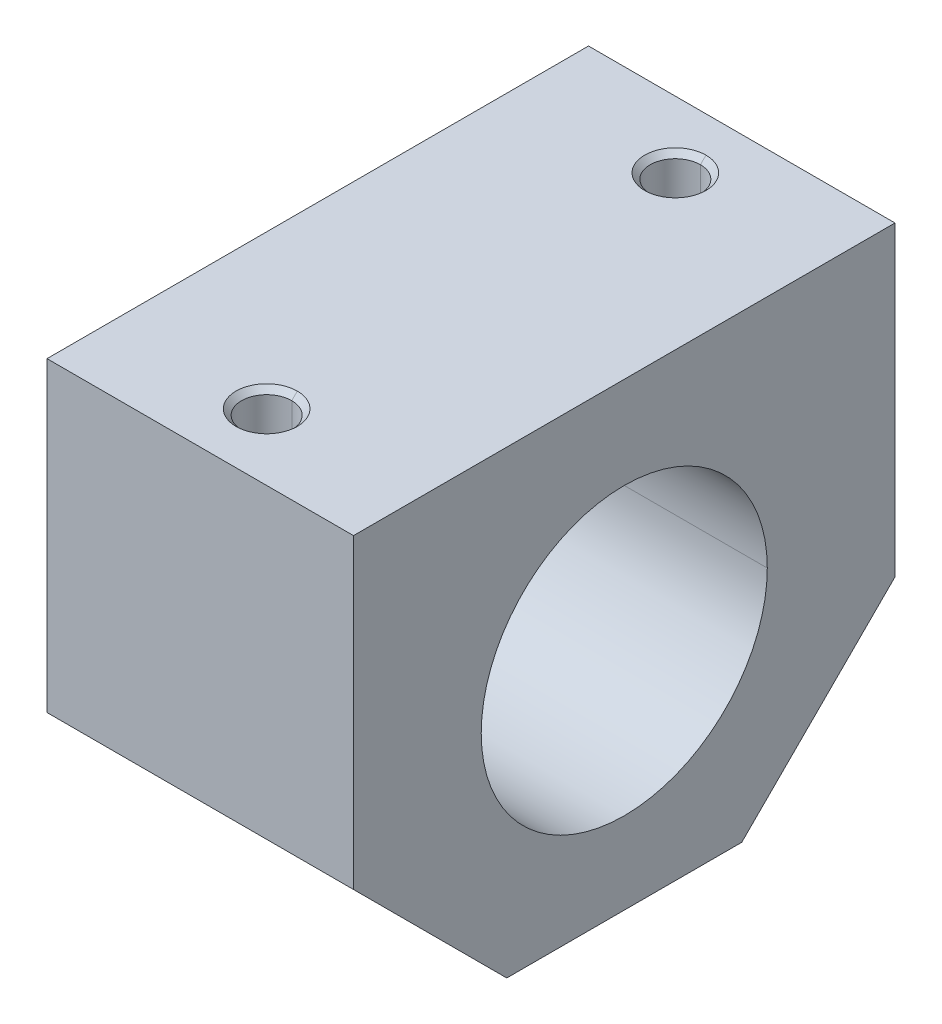
ISO-10303-21;
HEADER;
FILE_DESCRIPTION(('STEP AP214'),'2;1');
FILE_NAME('part.step','',(''),(''),'','','');
FILE_SCHEMA(('AUTOMOTIVE_DESIGN { 1 0 10303 214 1 1 1 1 }'));
ENDSEC;
DATA;
#1=APPLICATION_CONTEXT('core data for automotive mechanical design processes');
#2=APPLICATION_PROTOCOL_DEFINITION('international standard','automotive_design',2000,#1);
#3=PRODUCT_CONTEXT('',#1,'mechanical');
#4=PRODUCT('Part','Part','',(#3));
#5=PRODUCT_RELATED_PRODUCT_CATEGORY('part','',(#4));
#6=PRODUCT_DEFINITION_FORMATION('','',#4);
#7=PRODUCT_DEFINITION_CONTEXT('part definition',#1,'design');
#8=PRODUCT_DEFINITION('design','',#6,#7);
#9=PRODUCT_DEFINITION_SHAPE('','',#8);
#10=(LENGTH_UNIT() NAMED_UNIT(*) SI_UNIT(.MILLI.,.METRE.));
#11=(NAMED_UNIT(*) PLANE_ANGLE_UNIT() SI_UNIT($,.RADIAN.));
#12=(NAMED_UNIT(*) SI_UNIT($,.STERADIAN.) SOLID_ANGLE_UNIT());
#13=UNCERTAINTY_MEASURE_WITH_UNIT(LENGTH_MEASURE(1.E-05),#10,'distance_accuracy_value','');
#14=(GEOMETRIC_REPRESENTATION_CONTEXT(3) GLOBAL_UNCERTAINTY_ASSIGNED_CONTEXT((#13)) GLOBAL_UNIT_ASSIGNED_CONTEXT((#10,
#11,#12)) REPRESENTATION_CONTEXT('',''));
#15=CARTESIAN_POINT('',(0.,0.,0.));
#16=DIRECTION('',(0.,0.,1.));
#17=DIRECTION('',(1.,0.,0.));
#18=AXIS2_PLACEMENT_3D('',#15,#16,#17);
#19=CARTESIAN_POINT('',(15.,-22.,-11.5));
#20=DIRECTION('',(0.,0.707106781186548,0.707106781186548));
#21=DIRECTION('',(0.,-0.707106781186548,0.707106781186548));
#22=AXIS2_PLACEMENT_3D('',#19,#20,#21);
#23=PLANE('',#22);
#24=CARTESIAN_POINT('',(0.,-18.800000000016,-14.699999999984));
#25=CARTESIAN_POINT('',(5.3,-18.800000000016,-14.699999999984));
#26=CARTESIAN_POINT('',(5.3,-13.4999250462421,-20.0000749537579));
#27=CARTESIAN_POINT('',(5.29985009460424,-8.19999999998402,-25.300000000016));
#28=CARTESIAN_POINT('',(0.,-8.19999999998402,-25.300000000016));
#29=(BOUNDED_CURVE() B_SPLINE_CURVE(2,(#24,#25,#26,#27,#28),.UNSPECIFIED.,.F.,
.F.) B_SPLINE_CURVE_WITH_KNOTS((3,1,1,3),(0.,0.5,0.50001,1.),
.UNSPECIFIED.) CURVE() GEOMETRIC_REPRESENTATION_ITEM() RATIONAL_B_SPLINE_CURVE((1.,
0.707106781186547,0.999994142135624,0.707112639050924,1.)) REPRESENTATION_ITEM(''));
#30=CARTESIAN_POINT('',(0.,-18.8,-14.7));
#31=VERTEX_POINT('',#30);
#32=CARTESIAN_POINT('',(0.,-8.19999999998402,-25.3));
#33=VERTEX_POINT('',#32);
#34=EDGE_CURVE('E11',#31,#33,#29,.T.);
#35=ORIENTED_EDGE('',*,*,#34,.T.);
#36=CARTESIAN_POINT('',(0.,-8.19999999998402,-25.300000000016));
#37=CARTESIAN_POINT('',(-5.30000000000001,-8.19999999998402,-25.300000000016));
#38=CARTESIAN_POINT('',(-5.30000000000001,-13.5000749537579,-19.9999250462421));
#39=CARTESIAN_POINT('',(-5.29985009460425,-18.800000000016,-14.699999999984));
#40=CARTESIAN_POINT('',(0.,-18.800000000016,-14.699999999984));
#41=(BOUNDED_CURVE() B_SPLINE_CURVE(2,(#36,#37,#38,#39,#40),.UNSPECIFIED.,.F.,
.F.) B_SPLINE_CURVE_WITH_KNOTS((3,1,1,3),(0.,0.5,0.50001,1.),
.UNSPECIFIED.) CURVE() GEOMETRIC_REPRESENTATION_ITEM() RATIONAL_B_SPLINE_CURVE((1.,
0.707106781186548,0.999994142135624,0.707112639050924,1.)) REPRESENTATION_ITEM(''));
#42=EDGE_CURVE('E26',#33,#31,#41,.T.);
#43=ORIENTED_EDGE('',*,*,#42,.T.);
#44=EDGE_LOOP('',(#35,#43));
#45=FACE_BOUND('',#44,.T.);
#46=DIRECTION('',(0.,0.707106781186548,-0.707106781186548));
#47=VECTOR('',#46,1.);
#48=CARTESIAN_POINT('',(-15.,-22.,-11.5));
#49=LINE('',#48,#47);
#50=CARTESIAN_POINT('',(-15.,-22.,-11.5));
#51=VERTEX_POINT('',#50);
#52=CARTESIAN_POINT('',(-15.,-7.,-26.5));
#53=VERTEX_POINT('',#52);
#54=EDGE_CURVE('E636',#51,#53,#49,.T.);
#55=ORIENTED_EDGE('',*,*,#54,.T.);
#56=DIRECTION('',(-1.,0.,0.));
#57=VECTOR('',#56,1.);
#58=CARTESIAN_POINT('',(15.,-7.,-26.5));
#59=LINE('',#58,#57);
#60=CARTESIAN_POINT('',(15.,-7.,-26.5));
#61=VERTEX_POINT('',#60);
#62=EDGE_CURVE('E630',#61,#53,#59,.T.);
#63=ORIENTED_EDGE('',*,*,#62,.F.);
#64=DIRECTION('',(0.,0.707106781186548,-0.707106781186548));
#65=VECTOR('',#64,1.);
#66=CARTESIAN_POINT('',(15.,-22.,-11.5));
#67=LINE('',#66,#65);
#68=CARTESIAN_POINT('',(15.,-22.,-11.5));
#69=VERTEX_POINT('',#68);
#70=EDGE_CURVE('E624',#69,#61,#67,.T.);
#71=ORIENTED_EDGE('',*,*,#70,.F.);
#72=DIRECTION('',(-1.,0.,0.));
#73=VECTOR('',#72,1.);
#74=CARTESIAN_POINT('',(15.,-22.,-11.5));
#75=LINE('',#74,#73);
#76=EDGE_CURVE('E619',#69,#51,#75,.T.);
#77=ORIENTED_EDGE('',*,*,#76,.T.);
#78=EDGE_LOOP('',(#55,#63,#71,#77));
#79=FACE_BOUND('',#78,.T.);
#80=ADVANCED_FACE('F17',(#45,#79),#23,.F.);
#81=CARTESIAN_POINT('',(15.,-22.,11.5));
#82=DIRECTION('',(0.,1.,0.));
#83=DIRECTION('',(0.,0.,1.));
#84=AXIS2_PLACEMENT_3D('',#81,#82,#83);
#85=PLANE('',#84);
#86=DIRECTION('',(0.,0.,-1.));
#87=VECTOR('',#86,1.);
#88=CARTESIAN_POINT('',(-15.,-22.,11.5));
#89=LINE('',#88,#87);
#90=CARTESIAN_POINT('',(-15.,-22.,11.5));
#91=VERTEX_POINT('',#90);
#92=EDGE_CURVE('E613',#91,#51,#89,.T.);
#93=ORIENTED_EDGE('',*,*,#92,.T.);
#94=ORIENTED_EDGE('',*,*,#76,.F.);
#95=DIRECTION('',(0.,0.,-1.));
#96=VECTOR('',#95,1.);
#97=CARTESIAN_POINT('',(15.,-22.,11.5));
#98=LINE('',#97,#96);
#99=CARTESIAN_POINT('',(15.,-22.,11.5));
#100=VERTEX_POINT('',#99);
#101=EDGE_CURVE('E607',#100,#69,#98,.T.);
#102=ORIENTED_EDGE('',*,*,#101,.F.);
#103=DIRECTION('',(-1.,0.,0.));
#104=VECTOR('',#103,1.);
#105=CARTESIAN_POINT('',(15.,-22.,11.5));
#106=LINE('',#105,#104);
#107=EDGE_CURVE('E604',#100,#91,#106,.T.);
#108=ORIENTED_EDGE('',*,*,#107,.T.);
#109=EDGE_LOOP('',(#93,#94,#102,#108));
#110=FACE_BOUND('',#109,.T.);
#111=ADVANCED_FACE('F590',(#110),#85,.F.);
#112=CARTESIAN_POINT('',(15.,-7.,26.5));
#113=DIRECTION('',(0.,0.707106781186548,-0.707106781186548));
#114=DIRECTION('',(0.,0.707106781186548,0.707106781186548));
#115=AXIS2_PLACEMENT_3D('',#112,#113,#114);
#116=PLANE('',#115);
#117=CARTESIAN_POINT('',(0.,-8.19999999998402,25.300000000016));
#118=CARTESIAN_POINT('',(5.3,-8.19999999998402,25.300000000016));
#119=CARTESIAN_POINT('',(5.3,-13.5000749537579,19.9999250462421));
#120=CARTESIAN_POINT('',(5.29985009460424,-18.800000000016,14.699999999984));
#121=CARTESIAN_POINT('',(0.,-18.800000000016,14.699999999984));
#122=(BOUNDED_CURVE() B_SPLINE_CURVE(2,(#117,#118,#119,#120,#121),.UNSPECIFIED.,.F.,
.F.) B_SPLINE_CURVE_WITH_KNOTS((3,1,1,3),(0.,0.5,0.50001,1.),
.UNSPECIFIED.) CURVE() GEOMETRIC_REPRESENTATION_ITEM() RATIONAL_B_SPLINE_CURVE((1.,
0.707106781186547,0.999994142135624,0.707112639050923,1.)) REPRESENTATION_ITEM(''));
#123=CARTESIAN_POINT('',(0.,-8.2,25.3));
#124=VERTEX_POINT('',#123);
#125=CARTESIAN_POINT('',(0.,-18.800000000016,14.7));
#126=VERTEX_POINT('',#125);
#127=EDGE_CURVE('E603',#124,#126,#122,.T.);
#128=ORIENTED_EDGE('',*,*,#127,.T.);
#129=CARTESIAN_POINT('',(0.,-18.800000000016,14.699999999984));
#130=CARTESIAN_POINT('',(-5.30000000000001,-18.800000000016,14.699999999984));
#131=CARTESIAN_POINT('',(-5.30000000000001,-13.4999250462421,20.0000749537579));
#132=CARTESIAN_POINT('',(-5.29985009460425,-8.19999999998403,25.300000000016));
#133=CARTESIAN_POINT('',(0.,-8.19999999998402,25.300000000016));
#134=(BOUNDED_CURVE() B_SPLINE_CURVE(2,(#129,#130,#131,#132,#133),.UNSPECIFIED.,.F.,
.F.) B_SPLINE_CURVE_WITH_KNOTS((3,1,1,3),(0.,0.5,0.50001,1.),
.UNSPECIFIED.) CURVE() GEOMETRIC_REPRESENTATION_ITEM() RATIONAL_B_SPLINE_CURVE((1.,
0.707106781186547,0.999994142135624,0.707112639050924,1.)) REPRESENTATION_ITEM(''));
#135=EDGE_CURVE('E221',#126,#124,#134,.T.);
#136=ORIENTED_EDGE('',*,*,#135,.T.);
#137=EDGE_LOOP('',(#128,#136));
#138=FACE_BOUND('',#137,.T.);
#139=DIRECTION('',(0.,-0.707106781186548,-0.707106781186548));
#140=VECTOR('',#139,1.);
#141=CARTESIAN_POINT('',(-15.,-7.,26.5));
#142=LINE('',#141,#140);
#143=CARTESIAN_POINT('',(-15.,-7.,26.5));
#144=VERTEX_POINT('',#143);
#145=EDGE_CURVE('E567',#144,#91,#142,.T.);
#146=ORIENTED_EDGE('',*,*,#145,.T.);
#147=ORIENTED_EDGE('',*,*,#107,.F.);
#148=DIRECTION('',(0.,-0.707106781186548,-0.707106781186548));
#149=VECTOR('',#148,1.);
#150=CARTESIAN_POINT('',(15.,-7.,26.5));
#151=LINE('',#150,#149);
#152=CARTESIAN_POINT('',(15.,-7.,26.5));
#153=VERTEX_POINT('',#152);
#154=EDGE_CURVE('E561',#153,#100,#151,.T.);
#155=ORIENTED_EDGE('',*,*,#154,.F.);
#156=DIRECTION('',(-1.,0.,0.));
#157=VECTOR('',#156,1.);
#158=CARTESIAN_POINT('',(15.,-7.,26.5));
#159=LINE('',#158,#157);
#160=EDGE_CURVE('E556',#153,#144,#159,.T.);
#161=ORIENTED_EDGE('',*,*,#160,.T.);
#162=EDGE_LOOP('',(#146,#147,#155,#161));
#163=FACE_BOUND('',#162,.T.);
#164=ADVANCED_FACE('F580',(#138,#163),#116,.F.);
#165=CARTESIAN_POINT('',(15.,23.,26.5));
#166=DIRECTION('',(0.,0.,-1.));
#167=DIRECTION('',(-1.,0.,0.));
#168=AXIS2_PLACEMENT_3D('',#165,#166,#167);
#169=PLANE('',#168);
#170=DIRECTION('',(0.,-1.,0.));
#171=VECTOR('',#170,1.);
#172=CARTESIAN_POINT('',(-15.,23.,26.5));
#173=LINE('',#172,#171);
#174=CARTESIAN_POINT('',(-15.,23.,26.5));
#175=VERTEX_POINT('',#174);
#176=EDGE_CURVE('E550',#175,#144,#173,.T.);
#177=ORIENTED_EDGE('',*,*,#176,.T.);
#178=ORIENTED_EDGE('',*,*,#160,.F.);
#179=DIRECTION('',(0.,-1.,0.));
#180=VECTOR('',#179,1.);
#181=CARTESIAN_POINT('',(15.,23.,26.5));
#182=LINE('',#181,#180);
#183=CARTESIAN_POINT('',(15.,23.,26.5));
#184=VERTEX_POINT('',#183);
#185=EDGE_CURVE('E544',#184,#153,#182,.T.);
#186=ORIENTED_EDGE('',*,*,#185,.F.);
#187=DIRECTION('',(-1.,0.,0.));
#188=VECTOR('',#187,1.);
#189=CARTESIAN_POINT('',(15.,23.,26.5));
#190=LINE('',#189,#188);
#191=EDGE_CURVE('E539',#184,#175,#190,.T.);
#192=ORIENTED_EDGE('',*,*,#191,.T.);
#193=EDGE_LOOP('',(#177,#178,#186,#192));
#194=FACE_BOUND('',#193,.T.);
#195=ADVANCED_FACE('F589',(#194),#169,.F.);
#196=CARTESIAN_POINT('',(15.,23.,-26.5));
#197=DIRECTION('',(0.,-1.,0.));
#198=DIRECTION('',(0.,0.,-1.));
#199=AXIS2_PLACEMENT_3D('',#196,#197,#198);
#200=PLANE('',#199);
#201=CARTESIAN_POINT('',(0.,23.,20.));
#202=DIRECTION('',(0.,1.,0.));
#203=DIRECTION('',(0.,0.,1.));
#204=AXIS2_PLACEMENT_3D('',#201,#202,#203);
#205=CIRCLE('',#204,3.);
#206=CARTESIAN_POINT('',(0.,23.,23.));
#207=VERTEX_POINT('',#206);
#208=CARTESIAN_POINT('',(0.,22.9999999999986,16.9999999999986));
#209=VERTEX_POINT('',#208);
#210=EDGE_CURVE('E533',#207,#209,#205,.T.);
#211=ORIENTED_EDGE('',*,*,#210,.F.);
#212=CARTESIAN_POINT('',(0.,23.,20.));
#213=DIRECTION('',(0.,1.,0.));
#214=DIRECTION('',(0.,0.,1.));
#215=AXIS2_PLACEMENT_3D('',#212,#213,#214);
#216=CIRCLE('',#215,3.);
#217=EDGE_CURVE('E527',#209,#207,#216,.T.);
#218=ORIENTED_EDGE('',*,*,#217,.F.);
#219=EDGE_LOOP('',(#211,#218));
#220=FACE_BOUND('',#219,.T.);
#221=CARTESIAN_POINT('',(0.,23.,-20.));
#222=DIRECTION('',(0.,-1.,0.));
#223=DIRECTION('',(0.,0.,-1.));
#224=AXIS2_PLACEMENT_3D('',#221,#222,#223);
#225=CIRCLE('',#224,3.);
#226=CARTESIAN_POINT('',(0.,23.,-23.));
#227=VERTEX_POINT('',#226);
#228=CARTESIAN_POINT('',(0.,23.,-17.));
#229=VERTEX_POINT('',#228);
#230=EDGE_CURVE('E522',#227,#229,#225,.T.);
#231=ORIENTED_EDGE('',*,*,#230,.T.);
#232=CARTESIAN_POINT('',(0.,23.,-20.));
#233=DIRECTION('',(0.,-1.,0.));
#234=DIRECTION('',(0.,0.,-1.));
#235=AXIS2_PLACEMENT_3D('',#232,#233,#234);
#236=CIRCLE('',#235,3.);
#237=EDGE_CURVE('E517',#229,#227,#236,.T.);
#238=ORIENTED_EDGE('',*,*,#237,.T.);
#239=EDGE_LOOP('',(#231,#238));
#240=FACE_BOUND('',#239,.T.);
#241=DIRECTION('',(0.,0.,1.));
#242=VECTOR('',#241,1.);
#243=CARTESIAN_POINT('',(-15.,23.,-26.5));
#244=LINE('',#243,#242);
#245=CARTESIAN_POINT('',(-15.,23.,-26.5));
#246=VERTEX_POINT('',#245);
#247=EDGE_CURVE('E511',#246,#175,#244,.T.);
#248=ORIENTED_EDGE('',*,*,#247,.T.);
#249=ORIENTED_EDGE('',*,*,#191,.F.);
#250=DIRECTION('',(0.,0.,1.));
#251=VECTOR('',#250,1.);
#252=CARTESIAN_POINT('',(15.,23.,-26.5));
#253=LINE('',#252,#251);
#254=CARTESIAN_POINT('',(15.,23.,-26.5));
#255=VERTEX_POINT('',#254);
#256=EDGE_CURVE('E505',#255,#184,#253,.T.);
#257=ORIENTED_EDGE('',*,*,#256,.F.);
#258=DIRECTION('',(-1.,0.,0.));
#259=VECTOR('',#258,1.);
#260=CARTESIAN_POINT('',(15.,23.,-26.5));
#261=LINE('',#260,#259);
#262=EDGE_CURVE('E500',#255,#246,#261,.T.);
#263=ORIENTED_EDGE('',*,*,#262,.T.);
#264=EDGE_LOOP('',(#248,#249,#257,#263));
#265=FACE_BOUND('',#264,.T.);
#266=ADVANCED_FACE('F699',(#220,#240,#265),#200,.F.);
#267=CARTESIAN_POINT('',(15.,-7.,-26.5));
#268=DIRECTION('',(0.,0.,1.));
#269=DIRECTION('',(1.,0.,0.));
#270=AXIS2_PLACEMENT_3D('',#267,#268,#269);
#271=PLANE('',#270);
#272=DIRECTION('',(0.,1.,0.));
#273=VECTOR('',#272,1.);
#274=CARTESIAN_POINT('',(-15.,-7.,-26.5));
#275=LINE('',#274,#273);
#276=EDGE_CURVE('E494',#53,#246,#275,.T.);
#277=ORIENTED_EDGE('',*,*,#276,.T.);
#278=ORIENTED_EDGE('',*,*,#262,.F.);
#279=DIRECTION('',(0.,1.,0.));
#280=VECTOR('',#279,1.);
#281=CARTESIAN_POINT('',(15.,-7.,-26.5));
#282=LINE('',#281,#280);
#283=EDGE_CURVE('E488',#61,#255,#282,.T.);
#284=ORIENTED_EDGE('',*,*,#283,.F.);
#285=ORIENTED_EDGE('',*,*,#62,.T.);
#286=EDGE_LOOP('',(#277,#278,#284,#285));
#287=FACE_BOUND('',#286,.T.);
#288=ADVANCED_FACE('F702',(#287),#271,.F.);
#289=CARTESIAN_POINT('',(15.,0.,0.));
#290=DIRECTION('',(1.,0.,0.));
#291=DIRECTION('',(0.,0.,-1.));
#292=AXIS2_PLACEMENT_3D('',#289,#290,#291);
#293=PLANE('',#292);
#294=CARTESIAN_POINT('',(15.,0.,0.));
#295=DIRECTION('',(1.,0.,0.));
#296=DIRECTION('',(0.,0.,-1.));
#297=AXIS2_PLACEMENT_3D('',#294,#295,#296);
#298=CIRCLE('',#297,14.);
#299=CARTESIAN_POINT('',(15.,0.,-14.));
#300=VERTEX_POINT('',#299);
#301=CARTESIAN_POINT('',(15.,0.,14.));
#302=VERTEX_POINT('',#301);
#303=EDGE_CURVE('E482',#300,#302,#298,.T.);
#304=ORIENTED_EDGE('',*,*,#303,.F.);
#305=CARTESIAN_POINT('',(15.,0.,0.));
#306=DIRECTION('',(1.,0.,0.));
#307=DIRECTION('',(0.,0.,-1.));
#308=AXIS2_PLACEMENT_3D('',#305,#306,#307);
#309=CIRCLE('',#308,14.);
#310=EDGE_CURVE('E476',#302,#300,#309,.T.);
#311=ORIENTED_EDGE('',*,*,#310,.F.);
#312=EDGE_LOOP('',(#304,#311));
#313=FACE_BOUND('',#312,.T.);
#314=ORIENTED_EDGE('',*,*,#185,.T.);
#315=ORIENTED_EDGE('',*,*,#154,.T.);
#316=ORIENTED_EDGE('',*,*,#101,.T.);
#317=ORIENTED_EDGE('',*,*,#70,.T.);
#318=ORIENTED_EDGE('',*,*,#283,.T.);
#319=ORIENTED_EDGE('',*,*,#256,.T.);
#320=EDGE_LOOP('',(#314,#315,#316,#317,#318,#319));
#321=FACE_BOUND('',#320,.T.);
#322=ADVANCED_FACE('F716',(#313,#321),#293,.T.);
#323=CARTESIAN_POINT('',(15.,0.,0.));
#324=DIRECTION('',(1.,0.,0.));
#325=DIRECTION('',(0.,1.,0.));
#326=AXIS2_PLACEMENT_3D('',#323,#324,#325);
#327=CYLINDRICAL_SURFACE('',#326,14.);
#328=CARTESIAN_POINT('',(-15.,0.,0.));
#329=DIRECTION('',(1.,0.,0.));
#330=DIRECTION('',(0.,0.,-1.));
#331=AXIS2_PLACEMENT_3D('',#328,#329,#330);
#332=CIRCLE('',#331,14.);
#333=CARTESIAN_POINT('',(-15.,0.,14.));
#334=VERTEX_POINT('',#333);
#335=CARTESIAN_POINT('',(-15.,0.,-14.));
#336=VERTEX_POINT('',#335);
#337=EDGE_CURVE('E470',#334,#336,#332,.T.);
#338=ORIENTED_EDGE('',*,*,#337,.F.);
#339=DIRECTION('',(1.,0.,0.));
#340=VECTOR('',#339,1.);
#341=CARTESIAN_POINT('',(-15.,0.,14.));
#342=LINE('',#341,#340);
#343=EDGE_CURVE('E464',#334,#302,#342,.T.);
#344=ORIENTED_EDGE('',*,*,#343,.T.);
#345=ORIENTED_EDGE('',*,*,#310,.T.);
#346=DIRECTION('',(1.,0.,0.));
#347=VECTOR('',#346,1.);
#348=CARTESIAN_POINT('',(-15.,0.,-14.));
#349=LINE('',#348,#347);
#350=EDGE_CURVE('E458',#336,#300,#349,.T.);
#351=ORIENTED_EDGE('',*,*,#350,.F.);
#352=EDGE_LOOP('',(#338,#344,#345,#351));
#353=FACE_BOUND('',#352,.T.);
#354=ADVANCED_FACE('F760',(#353),#327,.F.);
#355=CARTESIAN_POINT('',(15.,0.,0.));
#356=DIRECTION('',(1.,0.,0.));
#357=DIRECTION('',(0.,-1.,0.));
#358=AXIS2_PLACEMENT_3D('',#355,#356,#357);
#359=CYLINDRICAL_SURFACE('',#358,14.);
#360=ORIENTED_EDGE('',*,*,#303,.T.);
#361=ORIENTED_EDGE('',*,*,#343,.F.);
#362=CARTESIAN_POINT('',(-15.,0.,0.));
#363=DIRECTION('',(1.,0.,0.));
#364=DIRECTION('',(0.,0.,-1.));
#365=AXIS2_PLACEMENT_3D('',#362,#363,#364);
#366=CIRCLE('',#365,14.);
#367=EDGE_CURVE('E452',#336,#334,#366,.T.);
#368=ORIENTED_EDGE('',*,*,#367,.F.);
#369=ORIENTED_EDGE('',*,*,#350,.T.);
#370=EDGE_LOOP('',(#360,#361,#368,#369));
#371=FACE_BOUND('',#370,.T.);
#372=ADVANCED_FACE('F767',(#371),#359,.F.);
#373=CARTESIAN_POINT('',(-15.,0.,0.));
#374=DIRECTION('',(1.,0.,0.));
#375=DIRECTION('',(0.,0.,-1.));
#376=AXIS2_PLACEMENT_3D('',#373,#374,#375);
#377=PLANE('',#376);
#378=ORIENTED_EDGE('',*,*,#367,.T.);
#379=ORIENTED_EDGE('',*,*,#337,.T.);
#380=EDGE_LOOP('',(#378,#379));
#381=FACE_BOUND('',#380,.T.);
#382=ORIENTED_EDGE('',*,*,#176,.F.);
#383=ORIENTED_EDGE('',*,*,#247,.F.);
#384=ORIENTED_EDGE('',*,*,#276,.F.);
#385=ORIENTED_EDGE('',*,*,#54,.F.);
#386=ORIENTED_EDGE('',*,*,#92,.F.);
#387=ORIENTED_EDGE('',*,*,#145,.F.);
#388=EDGE_LOOP('',(#382,#383,#384,#385,#386,#387));
#389=FACE_BOUND('',#388,.T.);
#390=ADVANCED_FACE('F711',(#381,#389),#377,.F.);
#391=CARTESIAN_POINT('',(0.,23.,-20.));
#392=DIRECTION('',(0.,1.,0.));
#393=DIRECTION('',(1.,0.,0.));
#394=AXIS2_PLACEMENT_3D('',#391,#392,#393);
#395=CONICAL_SURFACE('',#394,3.,0.7853981634);
#396=ORIENTED_EDGE('',*,*,#237,.F.);
#397=DIRECTION('',(0.,0.707106781184738,0.707106781188357));
#398=VECTOR('',#397,1.);
#399=CARTESIAN_POINT('',(0.,22.4585000000014,-17.5415000000014));
#400=LINE('',#399,#398);
#401=CARTESIAN_POINT('',(0.,22.4585000000014,-17.5415000000014));
#402=VERTEX_POINT('',#401);
#403=EDGE_CURVE('E446',#402,#229,#400,.T.);
#404=ORIENTED_EDGE('',*,*,#403,.F.);
#405=CARTESIAN_POINT('',(0.,22.4585,-20.));
#406=DIRECTION('',(0.,-1.,0.));
#407=DIRECTION('',(0.,0.,-1.));
#408=AXIS2_PLACEMENT_3D('',#405,#406,#407);
#409=CIRCLE('',#408,2.4585);
#410=CARTESIAN_POINT('',(0.,22.4585,-22.4585));
#411=VERTEX_POINT('',#410);
#412=EDGE_CURVE('E441',#402,#411,#409,.T.);
#413=ORIENTED_EDGE('',*,*,#412,.T.);
#414=DIRECTION('',(0.,0.707106781184738,-0.707106781188357));
#415=VECTOR('',#414,1.);
#416=CARTESIAN_POINT('',(0.,22.4585000000014,-22.4584999999986));
#417=LINE('',#416,#415);
#418=EDGE_CURVE('E435',#411,#227,#417,.T.);
#419=ORIENTED_EDGE('',*,*,#418,.T.);
#420=EDGE_LOOP('',(#396,#404,#413,#419));
#421=FACE_BOUND('',#420,.T.);
#422=ADVANCED_FACE('F694',(#421),#395,.F.);
#423=CARTESIAN_POINT('',(0.,23.,-20.));
#424=DIRECTION('',(0.,1.,0.));
#425=DIRECTION('',(-1.,0.,0.));
#426=AXIS2_PLACEMENT_3D('',#423,#424,#425);
#427=CONICAL_SURFACE('',#426,3.,0.7853981634);
#428=CARTESIAN_POINT('',(0.,22.4585,-20.));
#429=DIRECTION('',(0.,-1.,0.));
#430=DIRECTION('',(0.,0.,-1.));
#431=AXIS2_PLACEMENT_3D('',#428,#429,#430);
#432=CIRCLE('',#431,2.4585);
#433=EDGE_CURVE('E429',#411,#402,#432,.T.);
#434=ORIENTED_EDGE('',*,*,#433,.T.);
#435=ORIENTED_EDGE('',*,*,#403,.T.);
#436=ORIENTED_EDGE('',*,*,#230,.F.);
#437=ORIENTED_EDGE('',*,*,#418,.F.);
#438=EDGE_LOOP('',(#434,#435,#436,#437));
#439=FACE_BOUND('',#438,.T.);
#440=ADVANCED_FACE('F697',(#439),#427,.F.);
#441=CARTESIAN_POINT('',(0.,-22.,-20.));
#442=DIRECTION('',(0.,1.,0.));
#443=DIRECTION('',(-1.,0.,0.));
#444=AXIS2_PLACEMENT_3D('',#441,#442,#443);
#445=CYLINDRICAL_SURFACE('',#444,2.4585);
#446=CARTESIAN_POINT('',(0.,10.,-20.));
#447=DIRECTION('',(0.,-1.,0.));
#448=DIRECTION('',(0.,0.,-1.));
#449=AXIS2_PLACEMENT_3D('',#446,#447,#448);
#450=CIRCLE('',#449,2.4585);
#451=CARTESIAN_POINT('',(0.,10.,-22.4585));
#452=VERTEX_POINT('',#451);
#453=CARTESIAN_POINT('',(0.,10.,-17.5415));
#454=VERTEX_POINT('',#453);
#455=EDGE_CURVE('E424',#452,#454,#450,.T.);
#456=ORIENTED_EDGE('',*,*,#455,.T.);
#457=DIRECTION('',(0.,1.,0.));
#458=VECTOR('',#457,1.);
#459=CARTESIAN_POINT('',(0.,10.,-17.5415));
#460=LINE('',#459,#458);
#461=EDGE_CURVE('E418',#454,#402,#460,.T.);
#462=ORIENTED_EDGE('',*,*,#461,.T.);
#463=ORIENTED_EDGE('',*,*,#433,.F.);
#464=DIRECTION('',(0.,1.,0.));
#465=VECTOR('',#464,1.);
#466=CARTESIAN_POINT('',(0.,10.,-22.4585));
#467=LINE('',#466,#465);
#468=EDGE_CURVE('E412',#452,#411,#467,.T.);
#469=ORIENTED_EDGE('',*,*,#468,.F.);
#470=EDGE_LOOP('',(#456,#462,#463,#469));
#471=FACE_BOUND('',#470,.T.);
#472=ADVANCED_FACE('F687',(#471),#445,.F.);
#473=CARTESIAN_POINT('',(0.,-22.,-20.));
#474=DIRECTION('',(0.,1.,0.));
#475=DIRECTION('',(1.,0.,0.));
#476=AXIS2_PLACEMENT_3D('',#473,#474,#475);
#477=CYLINDRICAL_SURFACE('',#476,2.4585);
#478=ORIENTED_EDGE('',*,*,#412,.F.);
#479=ORIENTED_EDGE('',*,*,#461,.F.);
#480=CARTESIAN_POINT('',(0.,10.,-20.));
#481=DIRECTION('',(0.,-1.,0.));
#482=DIRECTION('',(0.,0.,-1.));
#483=AXIS2_PLACEMENT_3D('',#480,#481,#482);
#484=CIRCLE('',#483,2.4585);
#485=EDGE_CURVE('E406',#454,#452,#484,.T.);
#486=ORIENTED_EDGE('',*,*,#485,.T.);
#487=ORIENTED_EDGE('',*,*,#468,.T.);
#488=EDGE_LOOP('',(#478,#479,#486,#487));
#489=FACE_BOUND('',#488,.T.);
#490=ADVANCED_FACE('F681',(#489),#477,.F.);
#491=CARTESIAN_POINT('',(0.,10.,-22.4585));
#492=DIRECTION('',(0.,-1.,0.));
#493=DIRECTION('',(0.,0.,-1.));
#494=AXIS2_PLACEMENT_3D('',#491,#492,#493);
#495=PLANE('',#494);
#496=CARTESIAN_POINT('',(0.,10.,-20.));
#497=DIRECTION('',(0.,-1.,0.));
#498=DIRECTION('',(0.,0.,-1.));
#499=AXIS2_PLACEMENT_3D('',#496,#497,#498);
#500=CIRCLE('',#499,2.65);
#501=CARTESIAN_POINT('',(0.,10.,-22.65));
#502=VERTEX_POINT('',#501);
#503=CARTESIAN_POINT('',(0.,10.,-17.35));
#504=VERTEX_POINT('',#503);
#505=EDGE_CURVE('E401',#502,#504,#500,.T.);
#506=ORIENTED_EDGE('',*,*,#505,.T.);
#507=CARTESIAN_POINT('',(0.,10.,-20.));
#508=DIRECTION('',(0.,-1.,0.));
#509=DIRECTION('',(0.,0.,-1.));
#510=AXIS2_PLACEMENT_3D('',#507,#508,#509);
#511=CIRCLE('',#510,2.65);
#512=EDGE_CURVE('E396',#504,#502,#511,.T.);
#513=ORIENTED_EDGE('',*,*,#512,.T.);
#514=EDGE_LOOP('',(#506,#513));
#515=FACE_BOUND('',#514,.T.);
#516=ORIENTED_EDGE('',*,*,#455,.F.);
#517=ORIENTED_EDGE('',*,*,#485,.F.);
#518=EDGE_LOOP('',(#516,#517));
#519=FACE_BOUND('',#518,.T.);
#520=ADVANCED_FACE('F678',(#515,#519),#495,.T.);
#521=CARTESIAN_POINT('',(0.,-22.,-20.));
#522=DIRECTION('',(0.,1.,0.));
#523=DIRECTION('',(1.,0.,0.));
#524=AXIS2_PLACEMENT_3D('',#521,#522,#523);
#525=CYLINDRICAL_SURFACE('',#524,2.65);
#526=ORIENTED_EDGE('',*,*,#512,.F.);
#527=DIRECTION('',(0.,1.,0.));
#528=VECTOR('',#527,1.);
#529=CARTESIAN_POINT('',(0.,1.,-17.35));
#530=LINE('',#529,#528);
#531=CARTESIAN_POINT('',(0.,1.,-17.35));
#532=VERTEX_POINT('',#531);
#533=EDGE_CURVE('E390',#532,#504,#530,.T.);
#534=ORIENTED_EDGE('',*,*,#533,.F.);
#535=CARTESIAN_POINT('',(0.,1.,-20.));
#536=DIRECTION('',(0.,-1.,0.));
#537=DIRECTION('',(0.,0.,-1.));
#538=AXIS2_PLACEMENT_3D('',#535,#536,#537);
#539=CIRCLE('',#538,2.65);
#540=CARTESIAN_POINT('',(0.,1.,-22.65));
#541=VERTEX_POINT('',#540);
#542=EDGE_CURVE('E385',#532,#541,#539,.T.);
#543=ORIENTED_EDGE('',*,*,#542,.T.);
#544=DIRECTION('',(0.,1.,0.));
#545=VECTOR('',#544,1.);
#546=CARTESIAN_POINT('',(0.,1.,-22.65));
#547=LINE('',#546,#545);
#548=EDGE_CURVE('E379',#541,#502,#547,.T.);
#549=ORIENTED_EDGE('',*,*,#548,.T.);
#550=EDGE_LOOP('',(#526,#534,#543,#549));
#551=FACE_BOUND('',#550,.T.);
#552=ADVANCED_FACE('F676',(#551),#525,.F.);
#553=CARTESIAN_POINT('',(0.,-22.,-20.));
#554=DIRECTION('',(0.,1.,0.));
#555=DIRECTION('',(-1.,0.,0.));
#556=AXIS2_PLACEMENT_3D('',#553,#554,#555);
#557=CYLINDRICAL_SURFACE('',#556,2.65);
#558=CARTESIAN_POINT('',(0.,1.,-20.));
#559=DIRECTION('',(0.,-1.,0.));
#560=DIRECTION('',(0.,0.,-1.));
#561=AXIS2_PLACEMENT_3D('',#558,#559,#560);
#562=CIRCLE('',#561,2.65);
#563=EDGE_CURVE('E373',#541,#532,#562,.T.);
#564=ORIENTED_EDGE('',*,*,#563,.T.);
#565=ORIENTED_EDGE('',*,*,#533,.T.);
#566=ORIENTED_EDGE('',*,*,#505,.F.);
#567=ORIENTED_EDGE('',*,*,#548,.F.);
#568=EDGE_LOOP('',(#564,#565,#566,#567));
#569=FACE_BOUND('',#568,.T.);
#570=ADVANCED_FACE('F668',(#569),#557,.F.);
#571=CARTESIAN_POINT('',(0.,1.,-22.65));
#572=DIRECTION('',(0.,-1.,0.));
#573=DIRECTION('',(0.,0.,-1.));
#574=AXIS2_PLACEMENT_3D('',#571,#572,#573);
#575=PLANE('',#574);
#576=CARTESIAN_POINT('',(0.,1.,-20.));
#577=DIRECTION('',(0.,-1.,0.));
#578=DIRECTION('',(0.,0.,-1.));
#579=AXIS2_PLACEMENT_3D('',#576,#577,#578);
#580=CIRCLE('',#579,5.3);
#581=CARTESIAN_POINT('',(0.,1.,-25.3));
#582=VERTEX_POINT('',#581);
#583=CARTESIAN_POINT('',(0.,1.,-14.7));
#584=VERTEX_POINT('',#583);
#585=EDGE_CURVE('E368',#582,#584,#580,.T.);
#586=ORIENTED_EDGE('',*,*,#585,.T.);
#587=CARTESIAN_POINT('',(0.,1.,-20.));
#588=DIRECTION('',(0.,-1.,0.));
#589=DIRECTION('',(0.,0.,-1.));
#590=AXIS2_PLACEMENT_3D('',#587,#588,#589);
#591=CIRCLE('',#590,5.3);
#592=EDGE_CURVE('E363',#584,#582,#591,.T.);
#593=ORIENTED_EDGE('',*,*,#592,.T.);
#594=EDGE_LOOP('',(#586,#593));
#595=FACE_BOUND('',#594,.T.);
#596=ORIENTED_EDGE('',*,*,#563,.F.);
#597=ORIENTED_EDGE('',*,*,#542,.F.);
#598=EDGE_LOOP('',(#596,#597));
#599=FACE_BOUND('',#598,.T.);
#600=ADVANCED_FACE('F342',(#595,#599),#575,.T.);
#601=CARTESIAN_POINT('',(0.,-22.,-20.));
#602=DIRECTION('',(0.,1.,0.));
#603=DIRECTION('',(1.,0.,0.));
#604=AXIS2_PLACEMENT_3D('',#601,#602,#603);
#605=CYLINDRICAL_SURFACE('',#604,5.3);
#606=ORIENTED_EDGE('',*,*,#592,.F.);
#607=DIRECTION('',(0.,1.,0.));
#608=VECTOR('',#607,1.);
#609=CARTESIAN_POINT('',(0.,-18.800000000016,-14.7));
#610=LINE('',#609,#608);
#611=EDGE_CURVE('E359',#31,#584,#610,.T.);
#612=ORIENTED_EDGE('',*,*,#611,.F.);
#613=ORIENTED_EDGE('',*,*,#42,.F.);
#614=DIRECTION('',(0.,1.,0.));
#615=VECTOR('',#614,1.);
#616=CARTESIAN_POINT('',(0.,-8.19999999998402,-25.3));
#617=LINE('',#616,#615);
#618=EDGE_CURVE('E317',#33,#582,#617,.T.);
#619=ORIENTED_EDGE('',*,*,#618,.T.);
#620=EDGE_LOOP('',(#606,#612,#613,#619));
#621=FACE_BOUND('',#620,.T.);
#622=ADVANCED_FACE('F336',(#621),#605,.F.);
#623=CARTESIAN_POINT('',(0.,-22.,-20.));
#624=DIRECTION('',(0.,1.,0.));
#625=DIRECTION('',(-1.,0.,0.));
#626=AXIS2_PLACEMENT_3D('',#623,#624,#625);
#627=CYLINDRICAL_SURFACE('',#626,5.3);
#628=ORIENTED_EDGE('',*,*,#34,.F.);
#629=ORIENTED_EDGE('',*,*,#611,.T.);
#630=ORIENTED_EDGE('',*,*,#585,.F.);
#631=ORIENTED_EDGE('',*,*,#618,.F.);
#632=EDGE_LOOP('',(#628,#629,#630,#631));
#633=FACE_BOUND('',#632,.T.);
#634=ADVANCED_FACE('F325',(#633),#627,.F.);
#635=CARTESIAN_POINT('',(0.,22.4585,20.));
#636=DIRECTION('',(0.,1.,0.));
#637=DIRECTION('',(1.,0.,0.));
#638=AXIS2_PLACEMENT_3D('',#635,#636,#637);
#639=CONICAL_SURFACE('',#638,2.4585,0.7853981634);
#640=CARTESIAN_POINT('',(0.,22.4585,20.));
#641=DIRECTION('',(0.,1.,0.));
#642=DIRECTION('',(0.,0.,1.));
#643=AXIS2_PLACEMENT_3D('',#640,#641,#642);
#644=CIRCLE('',#643,2.4585);
#645=CARTESIAN_POINT('',(0.,22.4585,17.5415));
#646=VERTEX_POINT('',#645);
#647=CARTESIAN_POINT('',(0.,22.4585,22.4585));
#648=VERTEX_POINT('',#647);
#649=EDGE_CURVE('E311',#646,#648,#644,.T.);
#650=ORIENTED_EDGE('',*,*,#649,.F.);
#651=DIRECTION('',(0.,0.707106781184738,-0.707106781188357));
#652=VECTOR('',#651,1.);
#653=CARTESIAN_POINT('',(0.,22.4585,17.5415));
#654=LINE('',#653,#652);
#655=EDGE_CURVE('E305',#646,#209,#654,.T.);
#656=ORIENTED_EDGE('',*,*,#655,.T.);
#657=ORIENTED_EDGE('',*,*,#217,.T.);
#658=DIRECTION('',(0.,0.707106781184738,0.707106781188357));
#659=VECTOR('',#658,1.);
#660=CARTESIAN_POINT('',(0.,22.4585,22.4585));
#661=LINE('',#660,#659);
#662=EDGE_CURVE('E299',#648,#207,#661,.T.);
#663=ORIENTED_EDGE('',*,*,#662,.F.);
#664=EDGE_LOOP('',(#650,#656,#657,#663));
#665=FACE_BOUND('',#664,.T.);
#666=ADVANCED_FACE('F335',(#665),#639,.F.);
#667=CARTESIAN_POINT('',(0.,22.4585,20.));
#668=DIRECTION('',(0.,1.,0.));
#669=DIRECTION('',(-1.,0.,0.));
#670=AXIS2_PLACEMENT_3D('',#667,#668,#669);
#671=CONICAL_SURFACE('',#670,2.4585,0.7853981634);
#672=ORIENTED_EDGE('',*,*,#210,.T.);
#673=ORIENTED_EDGE('',*,*,#655,.F.);
#674=CARTESIAN_POINT('',(0.,22.4585,20.));
#675=DIRECTION('',(0.,1.,0.));
#676=DIRECTION('',(0.,0.,1.));
#677=AXIS2_PLACEMENT_3D('',#674,#675,#676);
#678=CIRCLE('',#677,2.4585);
#679=EDGE_CURVE('E293',#648,#646,#678,.T.);
#680=ORIENTED_EDGE('',*,*,#679,.F.);
#681=ORIENTED_EDGE('',*,*,#662,.T.);
#682=EDGE_LOOP('',(#672,#673,#680,#681));
#683=FACE_BOUND('',#682,.T.);
#684=ADVANCED_FACE('F833',(#683),#671,.F.);
#685=CARTESIAN_POINT('',(0.,23.,20.));
#686=DIRECTION('',(0.,-1.,0.));
#687=DIRECTION('',(-1.,0.,0.));
#688=AXIS2_PLACEMENT_3D('',#685,#686,#687);
#689=CYLINDRICAL_SURFACE('',#688,2.4585);
#690=ORIENTED_EDGE('',*,*,#679,.T.);
#691=DIRECTION('',(0.,-1.,0.));
#692=VECTOR('',#691,1.);
#693=CARTESIAN_POINT('',(0.,22.4585,17.5415));
#694=LINE('',#693,#692);
#695=CARTESIAN_POINT('',(0.,10.,17.5415));
#696=VERTEX_POINT('',#695);
#697=EDGE_CURVE('E288',#646,#696,#694,.T.);
#698=ORIENTED_EDGE('',*,*,#697,.T.);
#699=CARTESIAN_POINT('',(0.,10.,20.));
#700=DIRECTION('',(0.,1.,0.));
#701=DIRECTION('',(0.,0.,1.));
#702=AXIS2_PLACEMENT_3D('',#699,#700,#701);
#703=CIRCLE('',#702,2.4585);
#704=CARTESIAN_POINT('',(0.,10.,22.4585));
#705=VERTEX_POINT('',#704);
#706=EDGE_CURVE('E282',#705,#696,#703,.T.);
#707=ORIENTED_EDGE('',*,*,#706,.F.);
#708=DIRECTION('',(0.,-1.,0.));
#709=VECTOR('',#708,1.);
#710=CARTESIAN_POINT('',(0.,22.4585,22.4585));
#711=LINE('',#710,#709);
#712=EDGE_CURVE('E277',#648,#705,#711,.T.);
#713=ORIENTED_EDGE('',*,*,#712,.F.);
#714=EDGE_LOOP('',(#690,#698,#707,#713));
#715=FACE_BOUND('',#714,.T.);
#716=ADVANCED_FACE('F840',(#715),#689,.F.);
#717=CARTESIAN_POINT('',(0.,23.,20.));
#718=DIRECTION('',(0.,-1.,0.));
#719=DIRECTION('',(1.,0.,0.));
#720=AXIS2_PLACEMENT_3D('',#717,#718,#719);
#721=CYLINDRICAL_SURFACE('',#720,2.4585);
#722=CARTESIAN_POINT('',(0.,10.,20.));
#723=DIRECTION('',(0.,1.,0.));
#724=DIRECTION('',(0.,0.,1.));
#725=AXIS2_PLACEMENT_3D('',#722,#723,#724);
#726=CIRCLE('',#725,2.4585);
#727=EDGE_CURVE('E271',#696,#705,#726,.T.);
#728=ORIENTED_EDGE('',*,*,#727,.F.);
#729=ORIENTED_EDGE('',*,*,#697,.F.);
#730=ORIENTED_EDGE('',*,*,#649,.T.);
#731=ORIENTED_EDGE('',*,*,#712,.T.);
#732=EDGE_LOOP('',(#728,#729,#730,#731));
#733=FACE_BOUND('',#732,.T.);
#734=ADVANCED_FACE('F847',(#733),#721,.F.);
#735=CARTESIAN_POINT('',(0.,10.,22.65));
#736=DIRECTION('',(0.,-1.,0.));
#737=DIRECTION('',(0.,0.,-1.));
#738=AXIS2_PLACEMENT_3D('',#735,#736,#737);
#739=PLANE('',#738);
#740=ORIENTED_EDGE('',*,*,#706,.T.);
#741=ORIENTED_EDGE('',*,*,#727,.T.);
#742=EDGE_LOOP('',(#740,#741));
#743=FACE_BOUND('',#742,.T.);
#744=CARTESIAN_POINT('',(0.,10.,20.));
#745=DIRECTION('',(0.,1.,0.));
#746=DIRECTION('',(0.,0.,1.));
#747=AXIS2_PLACEMENT_3D('',#744,#745,#746);
#748=CIRCLE('',#747,2.65);
#749=CARTESIAN_POINT('',(0.,10.,22.65));
#750=VERTEX_POINT('',#749);
#751=CARTESIAN_POINT('',(0.,10.,17.35));
#752=VERTEX_POINT('',#751);
#753=EDGE_CURVE('E265',#750,#752,#748,.T.);
#754=ORIENTED_EDGE('',*,*,#753,.F.);
#755=CARTESIAN_POINT('',(0.,10.,20.));
#756=DIRECTION('',(0.,1.,0.));
#757=DIRECTION('',(0.,0.,1.));
#758=AXIS2_PLACEMENT_3D('',#755,#756,#757);
#759=CIRCLE('',#758,2.65);
#760=EDGE_CURVE('E259',#752,#750,#759,.T.);
#761=ORIENTED_EDGE('',*,*,#760,.F.);
#762=EDGE_LOOP('',(#754,#761));
#763=FACE_BOUND('',#762,.T.);
#764=ADVANCED_FACE('F855',(#743,#763),#739,.T.);
#765=CARTESIAN_POINT('',(0.,23.,20.));
#766=DIRECTION('',(0.,-1.,0.));
#767=DIRECTION('',(1.,0.,0.));
#768=AXIS2_PLACEMENT_3D('',#765,#766,#767);
#769=CYLINDRICAL_SURFACE('',#768,2.65);
#770=CARTESIAN_POINT('',(0.,1.,20.));
#771=DIRECTION('',(0.,1.,0.));
#772=DIRECTION('',(0.,0.,1.));
#773=AXIS2_PLACEMENT_3D('',#770,#771,#772);
#774=CIRCLE('',#773,2.65);
#775=CARTESIAN_POINT('',(0.,1.,17.35));
#776=VERTEX_POINT('',#775);
#777=CARTESIAN_POINT('',(0.,1.,22.65));
#778=VERTEX_POINT('',#777);
#779=EDGE_CURVE('E254',#776,#778,#774,.T.);
#780=ORIENTED_EDGE('',*,*,#779,.F.);
#781=DIRECTION('',(0.,-1.,0.));
#782=VECTOR('',#781,1.);
#783=CARTESIAN_POINT('',(0.,10.,17.35));
#784=LINE('',#783,#782);
#785=EDGE_CURVE('E248',#752,#776,#784,.T.);
#786=ORIENTED_EDGE('',*,*,#785,.F.);
#787=ORIENTED_EDGE('',*,*,#760,.T.);
#788=DIRECTION('',(0.,-1.,0.));
#789=VECTOR('',#788,1.);
#790=CARTESIAN_POINT('',(0.,10.,22.65));
#791=LINE('',#790,#789);
#792=EDGE_CURVE('E237',#750,#778,#791,.T.);
#793=ORIENTED_EDGE('',*,*,#792,.T.);
#794=EDGE_LOOP('',(#780,#786,#787,#793));
#795=FACE_BOUND('',#794,.T.);
#796=ADVANCED_FACE('F861',(#795),#769,.F.);
#797=CARTESIAN_POINT('',(0.,23.,20.));
#798=DIRECTION('',(0.,-1.,0.));
#799=DIRECTION('',(-1.,0.,0.));
#800=AXIS2_PLACEMENT_3D('',#797,#798,#799);
#801=CYLINDRICAL_SURFACE('',#800,2.65);
#802=ORIENTED_EDGE('',*,*,#753,.T.);
#803=ORIENTED_EDGE('',*,*,#785,.T.);
#804=CARTESIAN_POINT('',(0.,1.,20.));
#805=DIRECTION('',(0.,1.,0.));
#806=DIRECTION('',(0.,0.,1.));
#807=AXIS2_PLACEMENT_3D('',#804,#805,#806);
#808=CIRCLE('',#807,2.65);
#809=EDGE_CURVE('E230',#778,#776,#808,.T.);
#810=ORIENTED_EDGE('',*,*,#809,.F.);
#811=ORIENTED_EDGE('',*,*,#792,.F.);
#812=EDGE_LOOP('',(#802,#803,#810,#811));
#813=FACE_BOUND('',#812,.T.);
#814=ADVANCED_FACE('F869',(#813),#801,.F.);
#815=CARTESIAN_POINT('',(0.,1.,25.3));
#816=DIRECTION('',(0.,-1.,0.));
#817=DIRECTION('',(0.,0.,-1.));
#818=AXIS2_PLACEMENT_3D('',#815,#816,#817);
#819=PLANE('',#818);
#820=ORIENTED_EDGE('',*,*,#809,.T.);
#821=ORIENTED_EDGE('',*,*,#779,.T.);
#822=EDGE_LOOP('',(#820,#821));
#823=FACE_BOUND('',#822,.T.);
#824=CARTESIAN_POINT('',(0.,1.,20.));
#825=DIRECTION('',(0.,1.,0.));
#826=DIRECTION('',(0.,0.,1.));
#827=AXIS2_PLACEMENT_3D('',#824,#825,#826);
#828=CIRCLE('',#827,5.3);
#829=CARTESIAN_POINT('',(0.,1.,25.3));
#830=VERTEX_POINT('',#829);
#831=CARTESIAN_POINT('',(0.,1.,14.7));
#832=VERTEX_POINT('',#831);
#833=EDGE_CURVE('E211',#830,#832,#828,.T.);
#834=ORIENTED_EDGE('',*,*,#833,.F.);
#835=CARTESIAN_POINT('',(0.,1.,20.));
#836=DIRECTION('',(0.,1.,0.));
#837=DIRECTION('',(0.,0.,1.));
#838=AXIS2_PLACEMENT_3D('',#835,#836,#837);
#839=CIRCLE('',#838,5.3);
#840=EDGE_CURVE('E207',#832,#830,#839,.T.);
#841=ORIENTED_EDGE('',*,*,#840,.F.);
#842=EDGE_LOOP('',(#834,#841));
#843=FACE_BOUND('',#842,.T.);
#844=ADVANCED_FACE('F209',(#823,#843),#819,.T.);
#845=CARTESIAN_POINT('',(0.,23.,20.));
#846=DIRECTION('',(0.,-1.,0.));
#847=DIRECTION('',(1.,0.,0.));
#848=AXIS2_PLACEMENT_3D('',#845,#846,#847);
#849=CYLINDRICAL_SURFACE('',#848,5.3);
#850=ORIENTED_EDGE('',*,*,#135,.F.);
#851=DIRECTION('',(0.,-1.,0.));
#852=VECTOR('',#851,1.);
#853=CARTESIAN_POINT('',(0.,1.,14.7));
#854=LINE('',#853,#852);
#855=EDGE_CURVE('E216',#832,#126,#854,.T.);
#856=ORIENTED_EDGE('',*,*,#855,.F.);
#857=ORIENTED_EDGE('',*,*,#840,.T.);
#858=DIRECTION('',(0.,-1.,0.));
#859=VECTOR('',#858,1.);
#860=CARTESIAN_POINT('',(0.,1.,25.3));
#861=LINE('',#860,#859);
#862=EDGE_CURVE('E226',#830,#124,#861,.T.);
#863=ORIENTED_EDGE('',*,*,#862,.T.);
#864=EDGE_LOOP('',(#850,#856,#857,#863));
#865=FACE_BOUND('',#864,.T.);
#866=ADVANCED_FACE('F220',(#865),#849,.F.);
#867=CARTESIAN_POINT('',(0.,23.,20.));
#868=DIRECTION('',(0.,-1.,0.));
#869=DIRECTION('',(-1.,0.,0.));
#870=AXIS2_PLACEMENT_3D('',#867,#868,#869);
#871=CYLINDRICAL_SURFACE('',#870,5.3);
#872=ORIENTED_EDGE('',*,*,#833,.T.);
#873=ORIENTED_EDGE('',*,*,#855,.T.);
#874=ORIENTED_EDGE('',*,*,#127,.F.);
#875=ORIENTED_EDGE('',*,*,#862,.F.);
#876=EDGE_LOOP('',(#872,#873,#874,#875));
#877=FACE_BOUND('',#876,.T.);
#878=ADVANCED_FACE('F228',(#877),#871,.F.);
#879=CLOSED_SHELL('',(#80,#111,#164,#195,#266,#288,#322,#354,#372,#390,#422,#440,#472,#490,#520,
#552,#570,#600,#622,#634,#666,#684,#716,#734,#764,#796,#814,#844,#866,#878));
#880=MANIFOLD_SOLID_BREP('B1',#879);
#881=ADVANCED_BREP_SHAPE_REPRESENTATION('',(#18,#880),#14);
#882=SHAPE_DEFINITION_REPRESENTATION(#9,#881);
ENDSEC;
END-ISO-10303-21;
